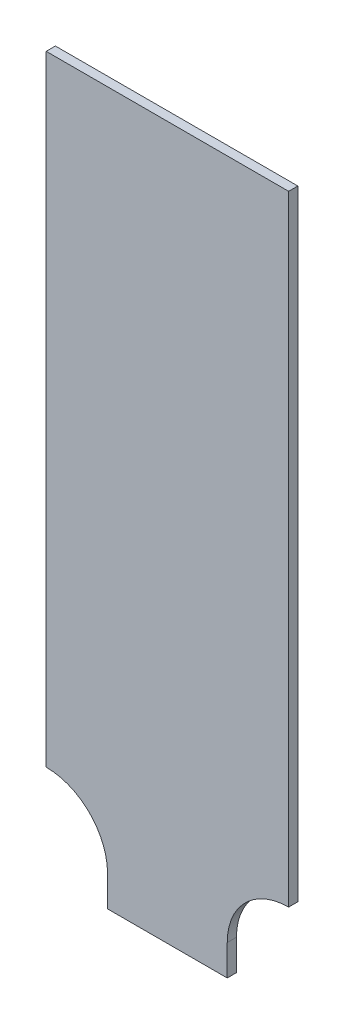
ISO-10303-21;
HEADER;
FILE_DESCRIPTION(('STEP AP214'),'2;1');
FILE_NAME('part.step','',(''),(''),'','','');
FILE_SCHEMA(('AUTOMOTIVE_DESIGN { 1 0 10303 214 1 1 1 1 }'));
ENDSEC;
DATA;
#1=APPLICATION_CONTEXT('core data for automotive mechanical design processes');
#2=APPLICATION_PROTOCOL_DEFINITION('international standard','automotive_design',2000,#1);
#3=PRODUCT_CONTEXT('',#1,'mechanical');
#4=PRODUCT('Part','Part','',(#3));
#5=PRODUCT_RELATED_PRODUCT_CATEGORY('part','',(#4));
#6=PRODUCT_DEFINITION_FORMATION('','',#4);
#7=PRODUCT_DEFINITION_CONTEXT('part definition',#1,'design');
#8=PRODUCT_DEFINITION('design','',#6,#7);
#9=PRODUCT_DEFINITION_SHAPE('','',#8);
#10=(LENGTH_UNIT() NAMED_UNIT(*) SI_UNIT(.MILLI.,.METRE.));
#11=(NAMED_UNIT(*) PLANE_ANGLE_UNIT() SI_UNIT($,.RADIAN.));
#12=(NAMED_UNIT(*) SI_UNIT($,.STERADIAN.) SOLID_ANGLE_UNIT());
#13=UNCERTAINTY_MEASURE_WITH_UNIT(LENGTH_MEASURE(1.E-05),#10,'distance_accuracy_value','');
#14=(GEOMETRIC_REPRESENTATION_CONTEXT(3) GLOBAL_UNCERTAINTY_ASSIGNED_CONTEXT((#13)) GLOBAL_UNIT_ASSIGNED_CONTEXT((#10,
#11,#12)) REPRESENTATION_CONTEXT('',''));
#15=CARTESIAN_POINT('',(0.,0.,0.));
#16=DIRECTION('',(0.,0.,1.));
#17=DIRECTION('',(1.,0.,0.));
#18=AXIS2_PLACEMENT_3D('',#15,#16,#17);
#19=CARTESIAN_POINT('',(-39.5,232.,3.));
#20=DIRECTION('',(1.,0.,0.));
#21=DIRECTION('',(0.,1.,0.));
#22=AXIS2_PLACEMENT_3D('',#19,#20,#21);
#23=PLANE('',#22);
#24=DIRECTION('',(0.,-1.,0.));
#25=VECTOR('',#24,1.);
#26=CARTESIAN_POINT('',(-39.5,232.,0.));
#27=LINE('',#26,#25);
#28=CARTESIAN_POINT('',(-39.5,232.,0.));
#29=VERTEX_POINT('',#28);
#30=CARTESIAN_POINT('',(-39.5,30.,0.));
#31=VERTEX_POINT('',#30);
#32=EDGE_CURVE('E127',#29,#31,#27,.T.);
#33=ORIENTED_EDGE('',*,*,#32,.T.);
#34=DIRECTION('',(0.,0.,-1.));
#35=VECTOR('',#34,1.);
#36=CARTESIAN_POINT('',(-39.5,30.,3.));
#37=LINE('',#36,#35);
#38=CARTESIAN_POINT('',(-39.5,30.,3.));
#39=VERTEX_POINT('',#38);
#40=EDGE_CURVE('E11',#39,#31,#37,.T.);
#41=ORIENTED_EDGE('',*,*,#40,.F.);
#42=DIRECTION('',(0.,-1.,0.));
#43=VECTOR('',#42,1.);
#44=CARTESIAN_POINT('',(-39.5,232.,3.));
#45=LINE('',#44,#43);
#46=CARTESIAN_POINT('',(-39.5,232.,3.));
#47=VERTEX_POINT('',#46);
#48=EDGE_CURVE('E141',#47,#39,#45,.T.);
#49=ORIENTED_EDGE('',*,*,#48,.F.);
#50=DIRECTION('',(0.,0.,-1.));
#51=VECTOR('',#50,1.);
#52=CARTESIAN_POINT('',(-39.5,232.,3.));
#53=LINE('',#52,#51);
#54=EDGE_CURVE('E123',#47,#29,#53,.T.);
#55=ORIENTED_EDGE('',*,*,#54,.T.);
#56=EDGE_LOOP('',(#33,#41,#49,#55));
#57=FACE_BOUND('',#56,.T.);
#58=ADVANCED_FACE('F31',(#57),#23,.F.);
#59=CARTESIAN_POINT('',(-39.5,9.99999999999999,3.));
#60=DIRECTION('',(0.,0.,-1.));
#61=DIRECTION('',(-1.,0.,0.));
#62=AXIS2_PLACEMENT_3D('',#59,#60,#61);
#63=CYLINDRICAL_SURFACE('',#62,20.);
#64=CARTESIAN_POINT('',(-39.5,9.99999999999999,0.));
#65=DIRECTION('',(0.,0.,-1.));
#66=DIRECTION('',(-1.,0.,0.));
#67=AXIS2_PLACEMENT_3D('',#64,#65,#66);
#68=CIRCLE('',#67,20.);
#69=CARTESIAN_POINT('',(-19.5,9.99999999999999,0.));
#70=VERTEX_POINT('',#69);
#71=EDGE_CURVE('E130',#31,#70,#68,.T.);
#72=ORIENTED_EDGE('',*,*,#71,.T.);
#73=DIRECTION('',(0.,0.,-1.));
#74=VECTOR('',#73,1.);
#75=CARTESIAN_POINT('',(-19.5,9.99999999999999,3.));
#76=LINE('',#75,#74);
#77=CARTESIAN_POINT('',(-19.5,9.99999999999999,3.));
#78=VERTEX_POINT('',#77);
#79=EDGE_CURVE('E39',#78,#70,#76,.T.);
#80=ORIENTED_EDGE('',*,*,#79,.F.);
#81=CARTESIAN_POINT('',(-39.5,9.99999999999999,3.));
#82=DIRECTION('',(0.,0.,-1.));
#83=DIRECTION('',(-1.,0.,0.));
#84=AXIS2_PLACEMENT_3D('',#81,#82,#83);
#85=CIRCLE('',#84,20.);
#86=EDGE_CURVE('E90',#39,#78,#85,.T.);
#87=ORIENTED_EDGE('',*,*,#86,.F.);
#88=ORIENTED_EDGE('',*,*,#40,.T.);
#89=EDGE_LOOP('',(#72,#80,#87,#88));
#90=FACE_BOUND('',#89,.T.);
#91=ADVANCED_FACE('F176',(#90),#63,.F.);
#92=CARTESIAN_POINT('',(-19.5,0.,3.));
#93=DIRECTION('',(1.,0.,0.));
#94=DIRECTION('',(0.,1.,0.));
#95=AXIS2_PLACEMENT_3D('',#92,#93,#94);
#96=PLANE('',#95);
#97=DIRECTION('',(0.,-1.,0.));
#98=VECTOR('',#97,1.);
#99=CARTESIAN_POINT('',(-19.5,0.,0.));
#100=LINE('',#99,#98);
#101=CARTESIAN_POINT('',(-19.5,0.,0.));
#102=VERTEX_POINT('',#101);
#103=EDGE_CURVE('E132',#70,#102,#100,.T.);
#104=ORIENTED_EDGE('',*,*,#103,.T.);
#105=DIRECTION('',(0.,0.,-1.));
#106=VECTOR('',#105,1.);
#107=CARTESIAN_POINT('',(-19.5,0.,3.));
#108=LINE('',#107,#106);
#109=CARTESIAN_POINT('',(-19.5,0.,3.));
#110=VERTEX_POINT('',#109);
#111=EDGE_CURVE('E148',#110,#102,#108,.T.);
#112=ORIENTED_EDGE('',*,*,#111,.F.);
#113=DIRECTION('',(0.,-1.,0.));
#114=VECTOR('',#113,1.);
#115=CARTESIAN_POINT('',(-19.5,0.,3.));
#116=LINE('',#115,#114);
#117=EDGE_CURVE('E156',#78,#110,#116,.T.);
#118=ORIENTED_EDGE('',*,*,#117,.F.);
#119=ORIENTED_EDGE('',*,*,#79,.T.);
#120=EDGE_LOOP('',(#104,#112,#118,#119));
#121=FACE_BOUND('',#120,.T.);
#122=ADVANCED_FACE('F154',(#121),#96,.F.);
#123=CARTESIAN_POINT('',(19.5,0.,3.));
#124=DIRECTION('',(0.,1.,0.));
#125=DIRECTION('',(0.,0.,1.));
#126=AXIS2_PLACEMENT_3D('',#123,#124,#125);
#127=PLANE('',#126);
#128=DIRECTION('',(1.,0.,0.));
#129=VECTOR('',#128,1.);
#130=CARTESIAN_POINT('',(19.5,0.,0.));
#131=LINE('',#130,#129);
#132=CARTESIAN_POINT('',(19.5,0.,0.));
#133=VERTEX_POINT('',#132);
#134=EDGE_CURVE('E134',#102,#133,#131,.T.);
#135=ORIENTED_EDGE('',*,*,#134,.T.);
#136=DIRECTION('',(0.,0.,-1.));
#137=VECTOR('',#136,1.);
#138=CARTESIAN_POINT('',(19.5,0.,3.));
#139=LINE('',#138,#137);
#140=CARTESIAN_POINT('',(19.5,0.,3.));
#141=VERTEX_POINT('',#140);
#142=EDGE_CURVE('E145',#141,#133,#139,.T.);
#143=ORIENTED_EDGE('',*,*,#142,.F.);
#144=DIRECTION('',(1.,0.,0.));
#145=VECTOR('',#144,1.);
#146=CARTESIAN_POINT('',(19.5,0.,3.));
#147=LINE('',#146,#145);
#148=EDGE_CURVE('E168',#110,#141,#147,.T.);
#149=ORIENTED_EDGE('',*,*,#148,.F.);
#150=ORIENTED_EDGE('',*,*,#111,.T.);
#151=EDGE_LOOP('',(#135,#143,#149,#150));
#152=FACE_BOUND('',#151,.T.);
#153=ADVANCED_FACE('F164',(#152),#127,.F.);
#154=CARTESIAN_POINT('',(19.5,0.,3.));
#155=DIRECTION('',(-1.,0.,0.));
#156=DIRECTION('',(0.,-1.,0.));
#157=AXIS2_PLACEMENT_3D('',#154,#155,#156);
#158=PLANE('',#157);
#159=DIRECTION('',(0.,1.,0.));
#160=VECTOR('',#159,1.);
#161=CARTESIAN_POINT('',(19.5,0.,0.));
#162=LINE('',#161,#160);
#163=CARTESIAN_POINT('',(19.5,9.99999999999999,0.));
#164=VERTEX_POINT('',#163);
#165=EDGE_CURVE('E136',#133,#164,#162,.T.);
#166=ORIENTED_EDGE('',*,*,#165,.T.);
#167=DIRECTION('',(0.,0.,-1.));
#168=VECTOR('',#167,1.);
#169=CARTESIAN_POINT('',(19.5,9.99999999999999,3.));
#170=LINE('',#169,#168);
#171=CARTESIAN_POINT('',(19.5,9.99999999999999,3.));
#172=VERTEX_POINT('',#171);
#173=EDGE_CURVE('E118',#172,#164,#170,.T.);
#174=ORIENTED_EDGE('',*,*,#173,.F.);
#175=DIRECTION('',(0.,1.,0.));
#176=VECTOR('',#175,1.);
#177=CARTESIAN_POINT('',(19.5,0.,3.));
#178=LINE('',#177,#176);
#179=EDGE_CURVE('E109',#141,#172,#178,.T.);
#180=ORIENTED_EDGE('',*,*,#179,.F.);
#181=ORIENTED_EDGE('',*,*,#142,.T.);
#182=EDGE_LOOP('',(#166,#174,#180,#181));
#183=FACE_BOUND('',#182,.T.);
#184=ADVANCED_FACE('F167',(#183),#158,.F.);
#185=CARTESIAN_POINT('',(39.5,9.99999999999999,3.));
#186=DIRECTION('',(0.,0.,-1.));
#187=DIRECTION('',(-1.,0.,0.));
#188=AXIS2_PLACEMENT_3D('',#185,#186,#187);
#189=CYLINDRICAL_SURFACE('',#188,20.);
#190=CARTESIAN_POINT('',(39.5,9.99999999999999,0.));
#191=DIRECTION('',(0.,0.,-1.));
#192=DIRECTION('',(1.,0.,0.));
#193=AXIS2_PLACEMENT_3D('',#190,#191,#192);
#194=CIRCLE('',#193,20.);
#195=CARTESIAN_POINT('',(39.5,30.,0.));
#196=VERTEX_POINT('',#195);
#197=EDGE_CURVE('E117',#164,#196,#194,.T.);
#198=ORIENTED_EDGE('',*,*,#197,.T.);
#199=DIRECTION('',(0.,0.,-1.));
#200=VECTOR('',#199,1.);
#201=CARTESIAN_POINT('',(39.5,30.,3.));
#202=LINE('',#201,#200);
#203=CARTESIAN_POINT('',(39.5,30.,3.));
#204=VERTEX_POINT('',#203);
#205=EDGE_CURVE('E114',#204,#196,#202,.T.);
#206=ORIENTED_EDGE('',*,*,#205,.F.);
#207=CARTESIAN_POINT('',(39.5,9.99999999999999,3.));
#208=DIRECTION('',(0.,0.,-1.));
#209=DIRECTION('',(1.,0.,0.));
#210=AXIS2_PLACEMENT_3D('',#207,#208,#209);
#211=CIRCLE('',#210,20.);
#212=EDGE_CURVE('E103',#172,#204,#211,.T.);
#213=ORIENTED_EDGE('',*,*,#212,.F.);
#214=ORIENTED_EDGE('',*,*,#173,.T.);
#215=EDGE_LOOP('',(#198,#206,#213,#214));
#216=FACE_BOUND('',#215,.T.);
#217=ADVANCED_FACE('F115',(#216),#189,.F.);
#218=CARTESIAN_POINT('',(39.5,232.,3.));
#219=DIRECTION('',(-1.,0.,0.));
#220=DIRECTION('',(0.,-1.,0.));
#221=AXIS2_PLACEMENT_3D('',#218,#219,#220);
#222=PLANE('',#221);
#223=DIRECTION('',(0.,1.,0.));
#224=VECTOR('',#223,1.);
#225=CARTESIAN_POINT('',(39.5,232.,0.));
#226=LINE('',#225,#224);
#227=CARTESIAN_POINT('',(39.5,232.,0.));
#228=VERTEX_POINT('',#227);
#229=EDGE_CURVE('E76',#196,#228,#226,.T.);
#230=ORIENTED_EDGE('',*,*,#229,.T.);
#231=DIRECTION('',(0.,0.,-1.));
#232=VECTOR('',#231,1.);
#233=CARTESIAN_POINT('',(39.5,232.,3.));
#234=LINE('',#233,#232);
#235=CARTESIAN_POINT('',(39.5,232.,3.));
#236=VERTEX_POINT('',#235);
#237=EDGE_CURVE('E119',#236,#228,#234,.T.);
#238=ORIENTED_EDGE('',*,*,#237,.F.);
#239=DIRECTION('',(0.,1.,0.));
#240=VECTOR('',#239,1.);
#241=CARTESIAN_POINT('',(39.5,232.,3.));
#242=LINE('',#241,#240);
#243=EDGE_CURVE('E107',#204,#236,#242,.T.);
#244=ORIENTED_EDGE('',*,*,#243,.F.);
#245=ORIENTED_EDGE('',*,*,#205,.T.);
#246=EDGE_LOOP('',(#230,#238,#244,#245));
#247=FACE_BOUND('',#246,.T.);
#248=ADVANCED_FACE('F121',(#247),#222,.F.);
#249=CARTESIAN_POINT('',(39.5,232.,3.));
#250=DIRECTION('',(0.,-1.,0.));
#251=DIRECTION('',(0.,0.,-1.));
#252=AXIS2_PLACEMENT_3D('',#249,#250,#251);
#253=PLANE('',#252);
#254=DIRECTION('',(-1.,0.,0.));
#255=VECTOR('',#254,1.);
#256=CARTESIAN_POINT('',(39.5,232.,0.));
#257=LINE('',#256,#255);
#258=EDGE_CURVE('E82',#228,#29,#257,.T.);
#259=ORIENTED_EDGE('',*,*,#258,.T.);
#260=ORIENTED_EDGE('',*,*,#54,.F.);
#261=DIRECTION('',(-1.,0.,0.));
#262=VECTOR('',#261,1.);
#263=CARTESIAN_POINT('',(39.5,232.,3.));
#264=LINE('',#263,#262);
#265=EDGE_CURVE('E47',#236,#47,#264,.T.);
#266=ORIENTED_EDGE('',*,*,#265,.F.);
#267=ORIENTED_EDGE('',*,*,#237,.T.);
#268=EDGE_LOOP('',(#259,#260,#266,#267));
#269=FACE_BOUND('',#268,.T.);
#270=ADVANCED_FACE('F192',(#269),#253,.F.);
#271=CARTESIAN_POINT('',(-39.5,9.99999999999999,3.));
#272=DIRECTION('',(0.,0.,-1.));
#273=DIRECTION('',(-1.,0.,0.));
#274=AXIS2_PLACEMENT_3D('',#271,#272,#273);
#275=PLANE('',#274);
#276=ORIENTED_EDGE('',*,*,#48,.T.);
#277=ORIENTED_EDGE('',*,*,#86,.T.);
#278=ORIENTED_EDGE('',*,*,#117,.T.);
#279=ORIENTED_EDGE('',*,*,#148,.T.);
#280=ORIENTED_EDGE('',*,*,#179,.T.);
#281=ORIENTED_EDGE('',*,*,#212,.T.);
#282=ORIENTED_EDGE('',*,*,#243,.T.);
#283=ORIENTED_EDGE('',*,*,#265,.T.);
#284=EDGE_LOOP('',(#276,#277,#278,#279,#280,#281,#282,#283));
#285=FACE_BOUND('',#284,.T.);
#286=ADVANCED_FACE('F105',(#285),#275,.F.);
#287=CARTESIAN_POINT('',(-39.5,9.99999999999999,0.));
#288=DIRECTION('',(0.,0.,-1.));
#289=DIRECTION('',(-1.,0.,0.));
#290=AXIS2_PLACEMENT_3D('',#287,#288,#289);
#291=PLANE('',#290);
#292=ORIENTED_EDGE('',*,*,#32,.F.);
#293=ORIENTED_EDGE('',*,*,#258,.F.);
#294=ORIENTED_EDGE('',*,*,#229,.F.);
#295=ORIENTED_EDGE('',*,*,#197,.F.);
#296=ORIENTED_EDGE('',*,*,#165,.F.);
#297=ORIENTED_EDGE('',*,*,#134,.F.);
#298=ORIENTED_EDGE('',*,*,#103,.F.);
#299=ORIENTED_EDGE('',*,*,#71,.F.);
#300=EDGE_LOOP('',(#292,#293,#294,#295,#296,#297,#298,#299));
#301=FACE_BOUND('',#300,.T.);
#302=ADVANCED_FACE('F160',(#301),#291,.T.);
#303=CLOSED_SHELL('',(#58,#91,#122,#153,#184,#217,#248,#270,#286,#302));
#304=MANIFOLD_SOLID_BREP('B2',#303);
#305=ADVANCED_BREP_SHAPE_REPRESENTATION('',(#18,#304),#14);
#306=SHAPE_DEFINITION_REPRESENTATION(#9,#305);
ENDSEC;
END-ISO-10303-21;
